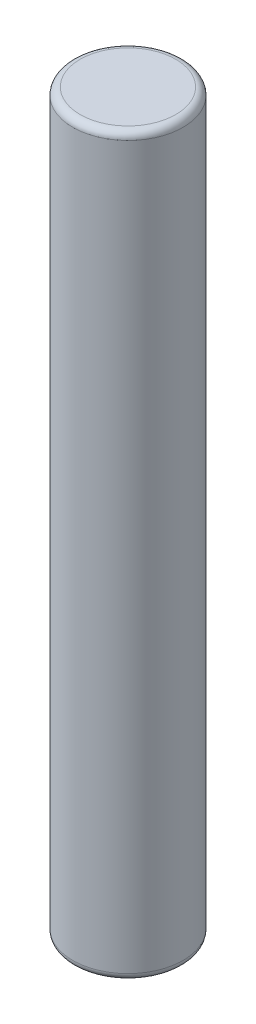
ISO-10303-21;
HEADER;
FILE_DESCRIPTION(('STEP AP214'),'2;1');
FILE_NAME('part.step','',(''),(''),'','','');
FILE_SCHEMA(('AUTOMOTIVE_DESIGN { 1 0 10303 214 1 1 1 1 }'));
ENDSEC;
DATA;
#1=APPLICATION_CONTEXT('core data for automotive mechanical design processes');
#2=APPLICATION_PROTOCOL_DEFINITION('international standard','automotive_design',2000,#1);
#3=PRODUCT_CONTEXT('',#1,'mechanical');
#4=PRODUCT('Part','Part','',(#3));
#5=PRODUCT_RELATED_PRODUCT_CATEGORY('part','',(#4));
#6=PRODUCT_DEFINITION_FORMATION('','',#4);
#7=PRODUCT_DEFINITION_CONTEXT('part definition',#1,'design');
#8=PRODUCT_DEFINITION('design','',#6,#7);
#9=PRODUCT_DEFINITION_SHAPE('','',#8);
#10=(LENGTH_UNIT() NAMED_UNIT(*) SI_UNIT(.MILLI.,.METRE.));
#11=(NAMED_UNIT(*) PLANE_ANGLE_UNIT() SI_UNIT($,.RADIAN.));
#12=(NAMED_UNIT(*) SI_UNIT($,.STERADIAN.) SOLID_ANGLE_UNIT());
#13=UNCERTAINTY_MEASURE_WITH_UNIT(LENGTH_MEASURE(1.E-05),#10,'distance_accuracy_value','');
#14=(GEOMETRIC_REPRESENTATION_CONTEXT(3) GLOBAL_UNCERTAINTY_ASSIGNED_CONTEXT((#13)) GLOBAL_UNIT_ASSIGNED_CONTEXT((#10,
#11,#12)) REPRESENTATION_CONTEXT('',''));
#15=CARTESIAN_POINT('',(0.,0.,0.));
#16=DIRECTION('',(0.,0.,1.));
#17=DIRECTION('',(1.,0.,0.));
#18=AXIS2_PLACEMENT_3D('',#15,#16,#17);
#19=CARTESIAN_POINT('',(0.,0.,0.));
#20=DIRECTION('',(0.,-1.,0.));
#21=DIRECTION('',(1.,0.,0.));
#22=AXIS2_PLACEMENT_3D('',#19,#20,#21);
#23=PLANE('',#22);
#24=CARTESIAN_POINT('',(0.,0.,0.));
#25=DIRECTION('',(0.,1.,0.));
#26=DIRECTION('',(0.,0.,1.));
#27=AXIS2_PLACEMENT_3D('',#24,#25,#26);
#28=CIRCLE('',#27,1.3);
#29=CARTESIAN_POINT('',(0.,0.,1.3));
#30=VERTEX_POINT('',#29);
#31=EDGE_CURVE('E62',#30,#30,#28,.T.);
#32=ORIENTED_EDGE('',*,*,#31,.F.);
#33=EDGE_LOOP('',(#32));
#34=FACE_BOUND('',#33,.T.);
#35=ADVANCED_FACE('F15',(#34),#23,.T.);
#36=CARTESIAN_POINT('',(0.,20.,0.));
#37=DIRECTION('',(0.,-1.,0.));
#38=DIRECTION('',(1.,0.,0.));
#39=AXIS2_PLACEMENT_3D('',#36,#37,#38);
#40=PLANE('',#39);
#41=CARTESIAN_POINT('',(0.,20.,0.));
#42=DIRECTION('',(0.,-1.,0.));
#43=DIRECTION('',(0.,0.,1.));
#44=AXIS2_PLACEMENT_3D('',#41,#42,#43);
#45=CIRCLE('',#44,1.3);
#46=CARTESIAN_POINT('',(0.,20.,1.3));
#47=VERTEX_POINT('',#46);
#48=EDGE_CURVE('E30',#47,#47,#45,.T.);
#49=ORIENTED_EDGE('',*,*,#48,.F.);
#50=EDGE_LOOP('',(#49));
#51=FACE_BOUND('',#50,.T.);
#52=ADVANCED_FACE('F75',(#51),#40,.F.);
#53=CARTESIAN_POINT('',(0.,0.199999999999999,0.));
#54=DIRECTION('',(0.,1.,0.));
#55=DIRECTION('',(0.,0.,-1.));
#56=AXIS2_PLACEMENT_3D('',#53,#54,#55);
#57=TOROIDAL_SURFACE('',#56,1.3,0.2);
#58=ORIENTED_EDGE('',*,*,#31,.T.);
#59=EDGE_LOOP('',(#58));
#60=FACE_BOUND('',#59,.T.);
#61=CARTESIAN_POINT('',(0.,0.199999999999999,0.));
#62=DIRECTION('',(0.,1.,0.));
#63=DIRECTION('',(-1.,0.,0.));
#64=AXIS2_PLACEMENT_3D('',#61,#62,#63);
#65=CIRCLE('',#64,1.5);
#66=CARTESIAN_POINT('',(-1.5,0.199999999999999,0.));
#67=VERTEX_POINT('',#66);
#68=EDGE_CURVE('E25',#67,#67,#65,.T.);
#69=ORIENTED_EDGE('',*,*,#68,.F.);
#70=EDGE_LOOP('',(#69));
#71=FACE_BOUND('',#70,.T.);
#72=ADVANCED_FACE('F43',(#60,#71),#57,.T.);
#73=CARTESIAN_POINT('',(0.,19.8,0.));
#74=DIRECTION('',(0.,1.,0.));
#75=DIRECTION('',(0.,0.,-1.));
#76=AXIS2_PLACEMENT_3D('',#73,#74,#75);
#77=TOROIDAL_SURFACE('',#76,1.3,0.2);
#78=CARTESIAN_POINT('',(0.,19.8,0.));
#79=DIRECTION('',(0.,1.,0.));
#80=DIRECTION('',(-1.,0.,0.));
#81=AXIS2_PLACEMENT_3D('',#78,#79,#80);
#82=CIRCLE('',#81,1.5);
#83=CARTESIAN_POINT('',(-1.5,19.8,0.));
#84=VERTEX_POINT('',#83);
#85=EDGE_CURVE('E10',#84,#84,#82,.F.);
#86=ORIENTED_EDGE('',*,*,#85,.F.);
#87=EDGE_LOOP('',(#86));
#88=FACE_BOUND('',#87,.T.);
#89=ORIENTED_EDGE('',*,*,#48,.T.);
#90=EDGE_LOOP('',(#89));
#91=FACE_BOUND('',#90,.T.);
#92=ADVANCED_FACE('F38',(#88,#91),#77,.T.);
#93=CARTESIAN_POINT('',(0.,20.,0.));
#94=DIRECTION('',(0.,1.,0.));
#95=DIRECTION('',(-1.,0.,0.));
#96=AXIS2_PLACEMENT_3D('',#93,#94,#95);
#97=CYLINDRICAL_SURFACE('',#96,1.5);
#98=ORIENTED_EDGE('',*,*,#85,.T.);
#99=EDGE_LOOP('',(#98));
#100=FACE_BOUND('',#99,.T.);
#101=ORIENTED_EDGE('',*,*,#68,.T.);
#102=EDGE_LOOP('',(#101));
#103=FACE_BOUND('',#102,.T.);
#104=ADVANCED_FACE('F42',(#100,#103),#97,.T.);
#105=CLOSED_SHELL('',(#35,#52,#72,#92,#104));
#106=MANIFOLD_SOLID_BREP('B1',#105);
#107=ADVANCED_BREP_SHAPE_REPRESENTATION('',(#18,#106),#14);
#108=SHAPE_DEFINITION_REPRESENTATION(#9,#107);
ENDSEC;
END-ISO-10303-21;
